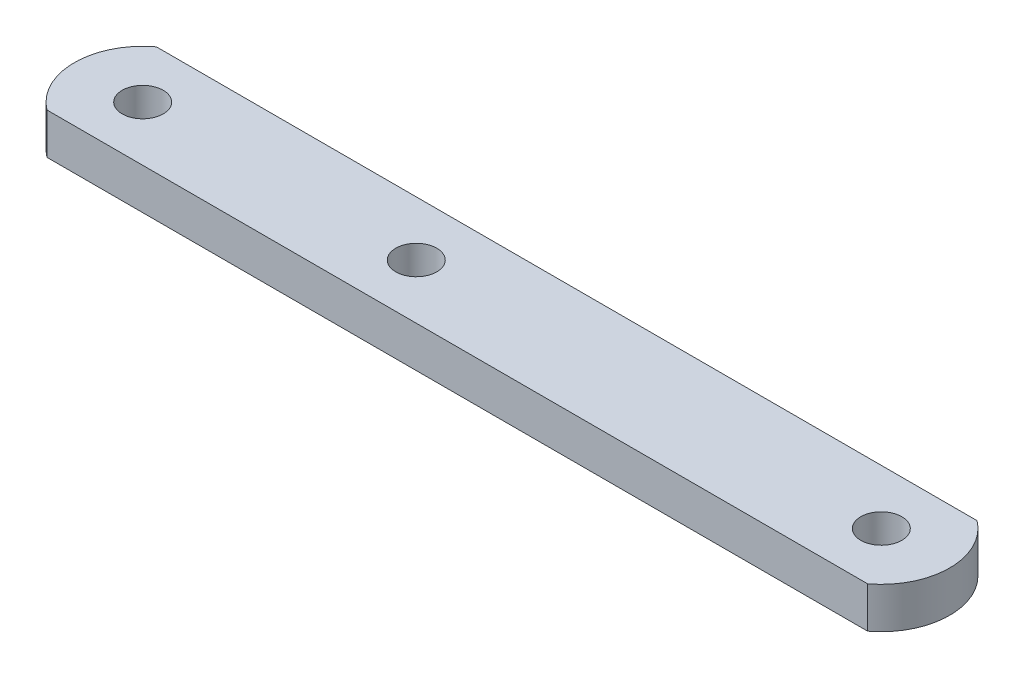
ISO-10303-21;
HEADER;
FILE_DESCRIPTION(('STEP AP214'),'2;1');
FILE_NAME('part.step','',(''),(''),'','','');
FILE_SCHEMA(('AUTOMOTIVE_DESIGN { 1 0 10303 214 1 1 1 1 }'));
ENDSEC;
DATA;
#1=APPLICATION_CONTEXT('core data for automotive mechanical design processes');
#2=APPLICATION_PROTOCOL_DEFINITION('international standard','automotive_design',2000,#1);
#3=PRODUCT_CONTEXT('',#1,'mechanical');
#4=PRODUCT('Part','Part','',(#3));
#5=PRODUCT_RELATED_PRODUCT_CATEGORY('part','',(#4));
#6=PRODUCT_DEFINITION_FORMATION('','',#4);
#7=PRODUCT_DEFINITION_CONTEXT('part definition',#1,'design');
#8=PRODUCT_DEFINITION('design','',#6,#7);
#9=PRODUCT_DEFINITION_SHAPE('','',#8);
#10=(LENGTH_UNIT() NAMED_UNIT(*) SI_UNIT(.MILLI.,.METRE.));
#11=(NAMED_UNIT(*) PLANE_ANGLE_UNIT() SI_UNIT($,.RADIAN.));
#12=(NAMED_UNIT(*) SI_UNIT($,.STERADIAN.) SOLID_ANGLE_UNIT());
#13=UNCERTAINTY_MEASURE_WITH_UNIT(LENGTH_MEASURE(1.E-05),#10,'distance_accuracy_value','');
#14=(GEOMETRIC_REPRESENTATION_CONTEXT(3) GLOBAL_UNCERTAINTY_ASSIGNED_CONTEXT((#13)) GLOBAL_UNIT_ASSIGNED_CONTEXT((#10,
#11,#12)) REPRESENTATION_CONTEXT('',''));
#15=CARTESIAN_POINT('',(0.,0.,0.));
#16=DIRECTION('',(0.,0.,1.));
#17=DIRECTION('',(1.,0.,0.));
#18=AXIS2_PLACEMENT_3D('',#15,#16,#17);
#19=CARTESIAN_POINT('',(-3.,3.,-4.));
#20=DIRECTION('',(0.,-1.,0.));
#21=DIRECTION('',(0.,0.,-1.));
#22=AXIS2_PLACEMENT_3D('',#19,#20,#21);
#23=PLANE('',#22);
#24=CARTESIAN_POINT('',(-3.,3.,-4.));
#25=DIRECTION('',(0.,1.,0.));
#26=DIRECTION('',(0.,0.,-1.));
#27=AXIS2_PLACEMENT_3D('',#24,#25,#26);
#28=CIRCLE('',#27,5.);
#29=CARTESIAN_POINT('',(0.,3.,0.));
#30=VERTEX_POINT('',#29);
#31=CARTESIAN_POINT('',(0.,3.,-8.));
#32=VERTEX_POINT('',#31);
#33=EDGE_CURVE('E86',#30,#32,#28,.T.);
#34=ORIENTED_EDGE('',*,*,#33,.T.);
#35=DIRECTION('',(-1.,0.,0.));
#36=VECTOR('',#35,1.);
#37=CARTESIAN_POINT('',(0.,3.,-8.));
#38=LINE('',#37,#36);
#39=CARTESIAN_POINT('',(-60.,3.,-7.99999999999999));
#40=VERTEX_POINT('',#39);
#41=EDGE_CURVE('E81',#32,#40,#38,.T.);
#42=ORIENTED_EDGE('',*,*,#41,.T.);
#43=CARTESIAN_POINT('',(-57.,3.,-3.99999999999999));
#44=DIRECTION('',(0.,1.,0.));
#45=DIRECTION('',(0.,0.,1.));
#46=AXIS2_PLACEMENT_3D('',#43,#44,#45);
#47=CIRCLE('',#46,5.);
#48=CARTESIAN_POINT('',(-60.,3.,0.));
#49=VERTEX_POINT('',#48);
#50=EDGE_CURVE('E84',#40,#49,#47,.T.);
#51=ORIENTED_EDGE('',*,*,#50,.T.);
#52=DIRECTION('',(1.,0.,0.));
#53=VECTOR('',#52,1.);
#54=CARTESIAN_POINT('',(0.,3.,0.));
#55=LINE('',#54,#53);
#56=EDGE_CURVE('E51',#49,#30,#55,.T.);
#57=ORIENTED_EDGE('',*,*,#56,.T.);
#58=EDGE_LOOP('',(#34,#42,#51,#57));
#59=FACE_BOUND('',#58,.T.);
#60=CARTESIAN_POINT('',(-57.,3.,-3.99999999999999));
#61=DIRECTION('',(0.,1.,0.));
#62=DIRECTION('',(0.,0.,1.));
#63=AXIS2_PLACEMENT_3D('',#60,#61,#62);
#64=CIRCLE('',#63,1.5);
#65=CARTESIAN_POINT('',(-57.,3.,-2.49999999999999));
#66=VERTEX_POINT('',#65);
#67=EDGE_CURVE('E101',#66,#66,#64,.T.);
#68=ORIENTED_EDGE('',*,*,#67,.F.);
#69=EDGE_LOOP('',(#68));
#70=FACE_BOUND('',#69,.T.);
#71=CARTESIAN_POINT('',(-3.,3.,-4.));
#72=DIRECTION('',(0.,1.,0.));
#73=DIRECTION('',(0.,0.,-1.));
#74=AXIS2_PLACEMENT_3D('',#71,#72,#73);
#75=CIRCLE('',#74,1.5);
#76=CARTESIAN_POINT('',(-3.,3.,-5.5));
#77=VERTEX_POINT('',#76);
#78=EDGE_CURVE('E116',#77,#77,#75,.T.);
#79=ORIENTED_EDGE('',*,*,#78,.F.);
#80=EDGE_LOOP('',(#79));
#81=FACE_BOUND('',#80,.T.);
#82=CARTESIAN_POINT('',(-37.,3.,-3.99999999999999));
#83=DIRECTION('',(0.,1.,0.));
#84=DIRECTION('',(0.,0.,1.));
#85=AXIS2_PLACEMENT_3D('',#82,#83,#84);
#86=CIRCLE('',#85,1.5);
#87=CARTESIAN_POINT('',(-37.,3.,-2.49999999999999));
#88=VERTEX_POINT('',#87);
#89=EDGE_CURVE('E122',#88,#88,#86,.T.);
#90=ORIENTED_EDGE('',*,*,#89,.F.);
#91=EDGE_LOOP('',(#90));
#92=FACE_BOUND('',#91,.T.);
#93=ADVANCED_FACE('F34',(#59,#70,#81,#92),#23,.F.);
#94=CARTESIAN_POINT('',(-3.,0.,-4.));
#95=DIRECTION('',(0.,-1.,0.));
#96=DIRECTION('',(0.,0.,-1.));
#97=AXIS2_PLACEMENT_3D('',#94,#95,#96);
#98=PLANE('',#97);
#99=CARTESIAN_POINT('',(-3.,0.,-4.));
#100=DIRECTION('',(0.,1.,0.));
#101=DIRECTION('',(0.,0.,-1.));
#102=AXIS2_PLACEMENT_3D('',#99,#100,#101);
#103=CIRCLE('',#102,1.5);
#104=CARTESIAN_POINT('',(-3.,0.,-5.5));
#105=VERTEX_POINT('',#104);
#106=EDGE_CURVE('E119',#105,#105,#103,.T.);
#107=ORIENTED_EDGE('',*,*,#106,.T.);
#108=EDGE_LOOP('',(#107));
#109=FACE_BOUND('',#108,.T.);
#110=CARTESIAN_POINT('',(-3.,0.,-4.));
#111=DIRECTION('',(0.,1.,0.));
#112=DIRECTION('',(0.,0.,-1.));
#113=AXIS2_PLACEMENT_3D('',#110,#111,#112);
#114=CIRCLE('',#113,5.);
#115=CARTESIAN_POINT('',(0.,0.,0.));
#116=VERTEX_POINT('',#115);
#117=CARTESIAN_POINT('',(0.,0.,-8.));
#118=VERTEX_POINT('',#117);
#119=EDGE_CURVE('E98',#116,#118,#114,.T.);
#120=ORIENTED_EDGE('',*,*,#119,.F.);
#121=DIRECTION('',(1.,0.,0.));
#122=VECTOR('',#121,1.);
#123=CARTESIAN_POINT('',(0.,0.,0.));
#124=LINE('',#123,#122);
#125=CARTESIAN_POINT('',(-60.,0.,0.));
#126=VERTEX_POINT('',#125);
#127=EDGE_CURVE('E74',#126,#116,#124,.T.);
#128=ORIENTED_EDGE('',*,*,#127,.F.);
#129=CARTESIAN_POINT('',(-57.,0.,-3.99999999999999));
#130=DIRECTION('',(0.,1.,0.));
#131=DIRECTION('',(0.,0.,1.));
#132=AXIS2_PLACEMENT_3D('',#129,#130,#131);
#133=CIRCLE('',#132,5.);
#134=CARTESIAN_POINT('',(-60.,0.,-7.99999999999999));
#135=VERTEX_POINT('',#134);
#136=EDGE_CURVE('E68',#135,#126,#133,.T.);
#137=ORIENTED_EDGE('',*,*,#136,.F.);
#138=DIRECTION('',(-1.,0.,0.));
#139=VECTOR('',#138,1.);
#140=CARTESIAN_POINT('',(0.,0.,-8.));
#141=LINE('',#140,#139);
#142=EDGE_CURVE('E90',#118,#135,#141,.T.);
#143=ORIENTED_EDGE('',*,*,#142,.F.);
#144=EDGE_LOOP('',(#120,#128,#137,#143));
#145=FACE_BOUND('',#144,.T.);
#146=CARTESIAN_POINT('',(-57.,0.,-3.99999999999999));
#147=DIRECTION('',(0.,1.,0.));
#148=DIRECTION('',(0.,0.,1.));
#149=AXIS2_PLACEMENT_3D('',#146,#147,#148);
#150=CIRCLE('',#149,1.5);
#151=CARTESIAN_POINT('',(-57.,0.,-2.49999999999999));
#152=VERTEX_POINT('',#151);
#153=EDGE_CURVE('E113',#152,#152,#150,.T.);
#154=ORIENTED_EDGE('',*,*,#153,.T.);
#155=EDGE_LOOP('',(#154));
#156=FACE_BOUND('',#155,.T.);
#157=CARTESIAN_POINT('',(-37.,0.,-3.99999999999999));
#158=DIRECTION('',(0.,1.,0.));
#159=DIRECTION('',(0.,0.,1.));
#160=AXIS2_PLACEMENT_3D('',#157,#158,#159);
#161=CIRCLE('',#160,1.5);
#162=CARTESIAN_POINT('',(-37.,0.,-2.49999999999999));
#163=VERTEX_POINT('',#162);
#164=EDGE_CURVE('E125',#163,#163,#161,.T.);
#165=ORIENTED_EDGE('',*,*,#164,.T.);
#166=EDGE_LOOP('',(#165));
#167=FACE_BOUND('',#166,.T.);
#168=ADVANCED_FACE('F109',(#109,#145,#156,#167),#98,.T.);
#169=CARTESIAN_POINT('',(-3.,3.,-4.));
#170=DIRECTION('',(0.,-1.,0.));
#171=DIRECTION('',(0.,0.,-1.));
#172=AXIS2_PLACEMENT_3D('',#169,#170,#171);
#173=CYLINDRICAL_SURFACE('',#172,5.);
#174=ORIENTED_EDGE('',*,*,#119,.T.);
#175=DIRECTION('',(0.,-1.,0.));
#176=VECTOR('',#175,1.);
#177=CARTESIAN_POINT('',(0.,3.,-8.));
#178=LINE('',#177,#176);
#179=EDGE_CURVE('E11',#32,#118,#178,.T.);
#180=ORIENTED_EDGE('',*,*,#179,.F.);
#181=ORIENTED_EDGE('',*,*,#33,.F.);
#182=DIRECTION('',(0.,-1.,0.));
#183=VECTOR('',#182,1.);
#184=CARTESIAN_POINT('',(0.,3.,0.));
#185=LINE('',#184,#183);
#186=EDGE_CURVE('E94',#30,#116,#185,.T.);
#187=ORIENTED_EDGE('',*,*,#186,.T.);
#188=EDGE_LOOP('',(#174,#180,#181,#187));
#189=FACE_BOUND('',#188,.T.);
#190=ADVANCED_FACE('F36',(#189),#173,.T.);
#191=CARTESIAN_POINT('',(0.,3.,-8.));
#192=DIRECTION('',(0.,0.,1.));
#193=DIRECTION('',(1.,0.,0.));
#194=AXIS2_PLACEMENT_3D('',#191,#192,#193);
#195=PLANE('',#194);
#196=ORIENTED_EDGE('',*,*,#142,.T.);
#197=DIRECTION('',(0.,-1.,0.));
#198=VECTOR('',#197,1.);
#199=CARTESIAN_POINT('',(-60.,3.,-7.99999999999999));
#200=LINE('',#199,#198);
#201=EDGE_CURVE('E43',#40,#135,#200,.T.);
#202=ORIENTED_EDGE('',*,*,#201,.F.);
#203=ORIENTED_EDGE('',*,*,#41,.F.);
#204=ORIENTED_EDGE('',*,*,#179,.T.);
#205=EDGE_LOOP('',(#196,#202,#203,#204));
#206=FACE_BOUND('',#205,.T.);
#207=ADVANCED_FACE('F89',(#206),#195,.F.);
#208=CARTESIAN_POINT('',(-57.,3.,-3.99999999999999));
#209=DIRECTION('',(0.,-1.,0.));
#210=DIRECTION('',(0.,0.,-1.));
#211=AXIS2_PLACEMENT_3D('',#208,#209,#210);
#212=CYLINDRICAL_SURFACE('',#211,5.);
#213=ORIENTED_EDGE('',*,*,#136,.T.);
#214=DIRECTION('',(0.,-1.,0.));
#215=VECTOR('',#214,1.);
#216=CARTESIAN_POINT('',(-60.,3.,0.));
#217=LINE('',#216,#215);
#218=EDGE_CURVE('E91',#49,#126,#217,.T.);
#219=ORIENTED_EDGE('',*,*,#218,.F.);
#220=ORIENTED_EDGE('',*,*,#50,.F.);
#221=ORIENTED_EDGE('',*,*,#201,.T.);
#222=EDGE_LOOP('',(#213,#219,#220,#221));
#223=FACE_BOUND('',#222,.T.);
#224=ADVANCED_FACE('F92',(#223),#212,.T.);
#225=CARTESIAN_POINT('',(0.,3.,0.));
#226=DIRECTION('',(0.,0.,-1.));
#227=DIRECTION('',(-1.,0.,0.));
#228=AXIS2_PLACEMENT_3D('',#225,#226,#227);
#229=PLANE('',#228);
#230=ORIENTED_EDGE('',*,*,#127,.T.);
#231=ORIENTED_EDGE('',*,*,#186,.F.);
#232=ORIENTED_EDGE('',*,*,#56,.F.);
#233=ORIENTED_EDGE('',*,*,#218,.T.);
#234=EDGE_LOOP('',(#230,#231,#232,#233));
#235=FACE_BOUND('',#234,.T.);
#236=ADVANCED_FACE('F106',(#235),#229,.F.);
#237=CARTESIAN_POINT('',(-57.,3.,-3.99999999999999));
#238=DIRECTION('',(0.,-1.,0.));
#239=DIRECTION('',(0.,0.,-1.));
#240=AXIS2_PLACEMENT_3D('',#237,#238,#239);
#241=CYLINDRICAL_SURFACE('',#240,1.5);
#242=ORIENTED_EDGE('',*,*,#67,.T.);
#243=EDGE_LOOP('',(#242));
#244=FACE_BOUND('',#243,.T.);
#245=ORIENTED_EDGE('',*,*,#153,.F.);
#246=EDGE_LOOP('',(#245));
#247=FACE_BOUND('',#246,.T.);
#248=ADVANCED_FACE('F142',(#244,#247),#241,.F.);
#249=CARTESIAN_POINT('',(-3.,3.,-4.));
#250=DIRECTION('',(0.,-1.,0.));
#251=DIRECTION('',(0.,0.,-1.));
#252=AXIS2_PLACEMENT_3D('',#249,#250,#251);
#253=CYLINDRICAL_SURFACE('',#252,1.5);
#254=ORIENTED_EDGE('',*,*,#78,.T.);
#255=EDGE_LOOP('',(#254));
#256=FACE_BOUND('',#255,.T.);
#257=ORIENTED_EDGE('',*,*,#106,.F.);
#258=EDGE_LOOP('',(#257));
#259=FACE_BOUND('',#258,.T.);
#260=ADVANCED_FACE('F188',(#256,#259),#253,.F.);
#261=CARTESIAN_POINT('',(-37.,3.,-3.99999999999999));
#262=DIRECTION('',(0.,-1.,0.));
#263=DIRECTION('',(0.,0.,-1.));
#264=AXIS2_PLACEMENT_3D('',#261,#262,#263);
#265=CYLINDRICAL_SURFACE('',#264,1.5);
#266=ORIENTED_EDGE('',*,*,#89,.T.);
#267=EDGE_LOOP('',(#266));
#268=FACE_BOUND('',#267,.T.);
#269=ORIENTED_EDGE('',*,*,#164,.F.);
#270=EDGE_LOOP('',(#269));
#271=FACE_BOUND('',#270,.T.);
#272=ADVANCED_FACE('F131',(#268,#271),#265,.F.);
#273=CLOSED_SHELL('',(#93,#168,#190,#207,#224,#236,#248,#260,#272));
#274=MANIFOLD_SOLID_BREP('B2',#273);
#275=ADVANCED_BREP_SHAPE_REPRESENTATION('',(#18,#274),#14);
#276=SHAPE_DEFINITION_REPRESENTATION(#9,#275);
ENDSEC;
END-ISO-10303-21;
